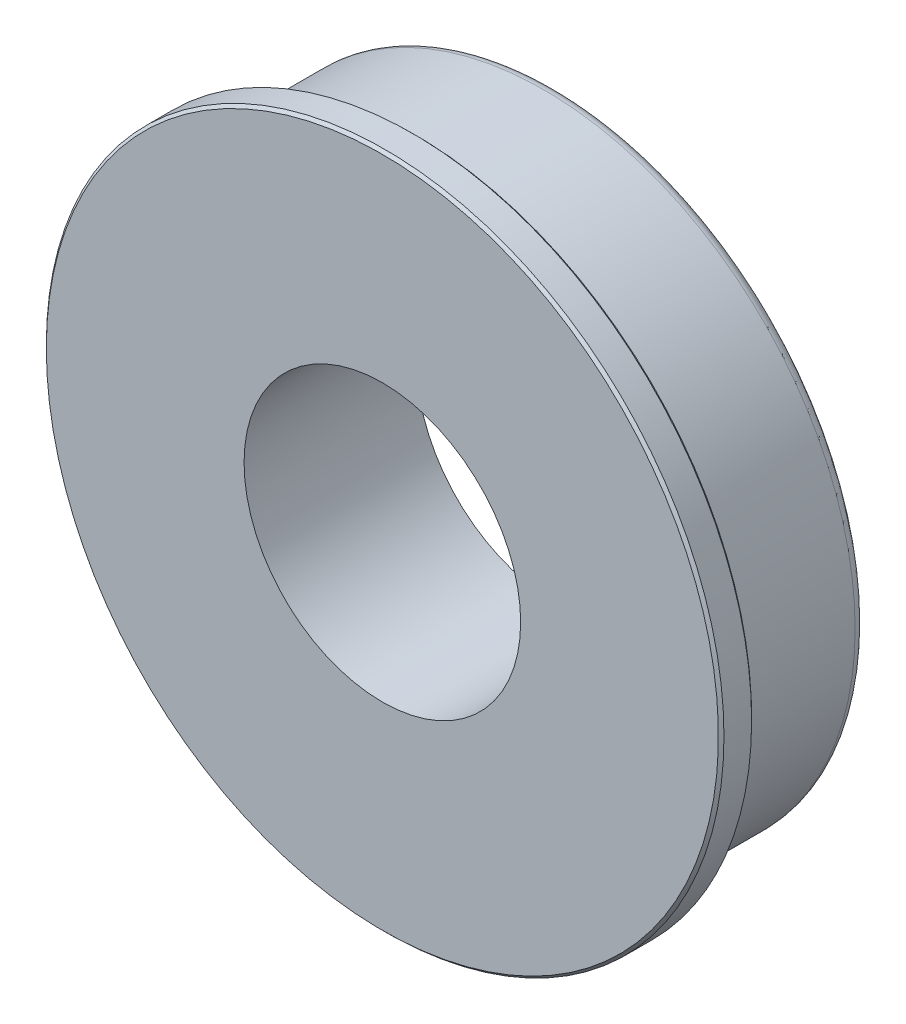
ISO-10303-21;
HEADER;
FILE_DESCRIPTION(('STEP AP214'),'2;1');
FILE_NAME('part.step','',(''),(''),'','','');
FILE_SCHEMA(('AUTOMOTIVE_DESIGN { 1 0 10303 214 1 1 1 1 }'));
ENDSEC;
DATA;
#1=APPLICATION_CONTEXT('core data for automotive mechanical design processes');
#2=APPLICATION_PROTOCOL_DEFINITION('international standard','automotive_design',2000,#1);
#3=PRODUCT_CONTEXT('',#1,'mechanical');
#4=PRODUCT('Part','Part','',(#3));
#5=PRODUCT_RELATED_PRODUCT_CATEGORY('part','',(#4));
#6=PRODUCT_DEFINITION_FORMATION('','',#4);
#7=PRODUCT_DEFINITION_CONTEXT('part definition',#1,'design');
#8=PRODUCT_DEFINITION('design','',#6,#7);
#9=PRODUCT_DEFINITION_SHAPE('','',#8);
#10=(LENGTH_UNIT() NAMED_UNIT(*) SI_UNIT(.MILLI.,.METRE.));
#11=(NAMED_UNIT(*) PLANE_ANGLE_UNIT() SI_UNIT($,.RADIAN.));
#12=(NAMED_UNIT(*) SI_UNIT($,.STERADIAN.) SOLID_ANGLE_UNIT());
#13=UNCERTAINTY_MEASURE_WITH_UNIT(LENGTH_MEASURE(1.E-05),#10,'distance_accuracy_value','');
#14=(GEOMETRIC_REPRESENTATION_CONTEXT(3) GLOBAL_UNCERTAINTY_ASSIGNED_CONTEXT((#13)) GLOBAL_UNIT_ASSIGNED_CONTEXT((#10,
#11,#12)) REPRESENTATION_CONTEXT('',''));
#15=CARTESIAN_POINT('',(0.,0.,0.));
#16=DIRECTION('',(0.,0.,1.));
#17=DIRECTION('',(1.,0.,0.));
#18=AXIS2_PLACEMENT_3D('',#15,#16,#17);
#19=CARTESIAN_POINT('',(0.,47.3069264516129,5.89534));
#20=DIRECTION('',(0.,0.,-1.));
#21=DIRECTION('',(-1.,0.,0.));
#22=AXIS2_PLACEMENT_3D('',#19,#20,#21);
#23=PLANE('',#22);
#24=CARTESIAN_POINT('',(0.,0.,5.89534));
#25=DIRECTION('',(0.,0.,1.));
#26=DIRECTION('',(1.,0.,0.));
#27=AXIS2_PLACEMENT_3D('',#24,#25,#26);
#28=CIRCLE('',#27,14.2875);
#29=CARTESIAN_POINT('',(14.2875,0.,5.89534));
#30=VERTEX_POINT('',#29);
#31=EDGE_CURVE('E46',#30,#30,#28,.F.);
#32=ORIENTED_EDGE('',*,*,#31,.F.);
#33=EDGE_LOOP('',(#32));
#34=FACE_BOUND('',#33,.T.);
#35=CARTESIAN_POINT('',(0.,0.,5.89534));
#36=DIRECTION('',(0.,0.,-1.));
#37=DIRECTION('',(-1.,0.,0.));
#38=AXIS2_PLACEMENT_3D('',#35,#36,#37);
#39=CIRCLE('',#38,13.97);
#40=CARTESIAN_POINT('',(-13.97,0.,5.89534));
#41=VERTEX_POINT('',#40);
#42=EDGE_CURVE('E19',#41,#41,#39,.F.);
#43=ORIENTED_EDGE('',*,*,#42,.F.);
#44=EDGE_LOOP('',(#43));
#45=FACE_BOUND('',#44,.T.);
#46=ADVANCED_FACE('F15',(#34,#45),#23,.F.);
#47=CARTESIAN_POINT('',(0.,0.,-57.007125));
#48=DIRECTION('',(0.,0.,-1.));
#49=DIRECTION('',(-1.,0.,0.));
#50=AXIS2_PLACEMENT_3D('',#47,#48,#49);
#51=CYLINDRICAL_SURFACE('',#50,13.97);
#52=ORIENTED_EDGE('',*,*,#42,.T.);
#53=EDGE_LOOP('',(#52));
#54=FACE_BOUND('',#53,.T.);
#55=CARTESIAN_POINT('',(0.,0.,6.40333999999999));
#56=DIRECTION('',(0.,0.,-1.));
#57=DIRECTION('',(-1.,0.,0.));
#58=AXIS2_PLACEMENT_3D('',#55,#56,#57);
#59=CIRCLE('',#58,13.97);
#60=CARTESIAN_POINT('',(-13.97,0.,6.40333999999999));
#61=VERTEX_POINT('',#60);
#62=EDGE_CURVE('E44',#61,#61,#59,.F.);
#63=ORIENTED_EDGE('',*,*,#62,.F.);
#64=EDGE_LOOP('',(#63));
#65=FACE_BOUND('',#64,.T.);
#66=ADVANCED_FACE('F53',(#54,#65),#51,.T.);
#67=CARTESIAN_POINT('',(0.,0.,6.40334));
#68=DIRECTION('',(0.,0.,1.));
#69=DIRECTION('',(1.,0.,0.));
#70=AXIS2_PLACEMENT_3D('',#67,#68,#69);
#71=CYLINDRICAL_SURFACE('',#70,14.2875);
#72=CARTESIAN_POINT('',(0.,0.,0.508));
#73=DIRECTION('',(0.,0.,-1.));
#74=DIRECTION('',(-1.,0.,0.));
#75=AXIS2_PLACEMENT_3D('',#72,#73,#74);
#76=CIRCLE('',#75,14.2875);
#77=CARTESIAN_POINT('',(-14.2875,0.,0.508));
#78=VERTEX_POINT('',#77);
#79=EDGE_CURVE('E31',#78,#78,#76,.T.);
#80=ORIENTED_EDGE('',*,*,#79,.F.);
#81=EDGE_LOOP('',(#80));
#82=FACE_BOUND('',#81,.T.);
#83=ORIENTED_EDGE('',*,*,#31,.T.);
#84=EDGE_LOOP('',(#83));
#85=FACE_BOUND('',#84,.T.);
#86=ADVANCED_FACE('F61',(#82,#85),#71,.T.);
#87=CARTESIAN_POINT('',(0.,0.,6.40334));
#88=DIRECTION('',(0.,0.,-1.));
#89=DIRECTION('',(-1.,0.,0.));
#90=AXIS2_PLACEMENT_3D('',#87,#88,#89);
#91=PLANE('',#90);
#92=CARTESIAN_POINT('',(0.,0.,6.40334000000001));
#93=DIRECTION('',(0.,0.,1.));
#94=DIRECTION('',(0.,-1.,0.));
#95=AXIS2_PLACEMENT_3D('',#92,#93,#94);
#96=CIRCLE('',#95,15.4305);
#97=CARTESIAN_POINT('',(0.,-15.4305,6.40334000000001));
#98=VERTEX_POINT('',#97);
#99=EDGE_CURVE('E41',#98,#98,#96,.T.);
#100=ORIENTED_EDGE('',*,*,#99,.F.);
#101=EDGE_LOOP('',(#100));
#102=FACE_BOUND('',#101,.T.);
#103=ORIENTED_EDGE('',*,*,#62,.T.);
#104=EDGE_LOOP('',(#103));
#105=FACE_BOUND('',#104,.T.);
#106=ADVANCED_FACE('F91',(#102,#105),#91,.T.);
#107=CARTESIAN_POINT('',(0.,0.,0.508000000000006));
#108=DIRECTION('',(0.,0.,-1.));
#109=DIRECTION('',(-1.,0.,0.));
#110=AXIS2_PLACEMENT_3D('',#107,#108,#109);
#111=TOROIDAL_SURFACE('',#110,13.7795,0.508000000000003);
#112=ORIENTED_EDGE('',*,*,#79,.T.);
#113=EDGE_LOOP('',(#112));
#114=FACE_BOUND('',#113,.T.);
#115=CARTESIAN_POINT('',(0.,0.,0.));
#116=DIRECTION('',(0.,0.,-1.));
#117=DIRECTION('',(-1.,0.,0.));
#118=AXIS2_PLACEMENT_3D('',#115,#116,#117);
#119=CIRCLE('',#118,13.7795);
#120=CARTESIAN_POINT('',(-13.7795,0.,0.));
#121=VERTEX_POINT('',#120);
#122=EDGE_CURVE('E38',#121,#121,#119,.T.);
#123=ORIENTED_EDGE('',*,*,#122,.F.);
#124=EDGE_LOOP('',(#123));
#125=FACE_BOUND('',#124,.T.);
#126=ADVANCED_FACE('F17',(#114,#125),#111,.T.);
#127=CARTESIAN_POINT('',(0.,0.,6.53034));
#128=DIRECTION('',(0.,0.,1.));
#129=DIRECTION('',(0.,-1.,0.));
#130=AXIS2_PLACEMENT_3D('',#127,#128,#129);
#131=CONICAL_SURFACE('',#130,15.5575000000007,0.785398163400003);
#132=CARTESIAN_POINT('',(0.,0.,6.53034));
#133=DIRECTION('',(0.,0.,1.));
#134=DIRECTION('',(1.,0.,0.));
#135=AXIS2_PLACEMENT_3D('',#132,#133,#134);
#136=CIRCLE('',#135,15.5575);
#137=CARTESIAN_POINT('',(15.5575,0.,6.53034));
#138=VERTEX_POINT('',#137);
#139=EDGE_CURVE('E37',#138,#138,#136,.T.);
#140=ORIENTED_EDGE('',*,*,#139,.F.);
#141=EDGE_LOOP('',(#140));
#142=FACE_BOUND('',#141,.T.);
#143=ORIENTED_EDGE('',*,*,#99,.T.);
#144=EDGE_LOOP('',(#143));
#145=FACE_BOUND('',#144,.T.);
#146=ADVANCED_FACE('F86',(#142,#145),#131,.T.);
#147=CARTESIAN_POINT('',(0.,0.,0.));
#148=DIRECTION('',(0.,0.,-1.));
#149=DIRECTION('',(-1.,0.,0.));
#150=AXIS2_PLACEMENT_3D('',#147,#148,#149);
#151=PLANE('',#150);
#152=ORIENTED_EDGE('',*,*,#122,.T.);
#153=EDGE_LOOP('',(#152));
#154=FACE_BOUND('',#153,.T.);
#155=CARTESIAN_POINT('',(0.,0.,0.));
#156=DIRECTION('',(0.,0.,-1.));
#157=DIRECTION('',(-1.,0.,0.));
#158=AXIS2_PLACEMENT_3D('',#155,#156,#157);
#159=CIRCLE('',#158,6.35);
#160=CARTESIAN_POINT('',(-6.34999999999999,0.,0.));
#161=VERTEX_POINT('',#160);
#162=EDGE_CURVE('E34',#161,#161,#159,.F.);
#163=ORIENTED_EDGE('',*,*,#162,.T.);
#164=EDGE_LOOP('',(#163));
#165=FACE_BOUND('',#164,.T.);
#166=ADVANCED_FACE('F82',(#154,#165),#151,.T.);
#167=CARTESIAN_POINT('',(0.,0.,7.92734));
#168=DIRECTION('',(0.,0.,1.));
#169=DIRECTION('',(1.,0.,0.));
#170=AXIS2_PLACEMENT_3D('',#167,#168,#169);
#171=CYLINDRICAL_SURFACE('',#170,15.5575);
#172=CARTESIAN_POINT('',(0.,0.,7.80033999999999));
#173=DIRECTION('',(0.,0.,-1.));
#174=DIRECTION('',(-1.,0.,0.));
#175=AXIS2_PLACEMENT_3D('',#172,#173,#174);
#176=CIRCLE('',#175,15.5575);
#177=CARTESIAN_POINT('',(-15.5575,0.,7.80033999999999));
#178=VERTEX_POINT('',#177);
#179=EDGE_CURVE('E28',#178,#178,#176,.F.);
#180=ORIENTED_EDGE('',*,*,#179,.F.);
#181=EDGE_LOOP('',(#180));
#182=FACE_BOUND('',#181,.T.);
#183=ORIENTED_EDGE('',*,*,#139,.T.);
#184=EDGE_LOOP('',(#183));
#185=FACE_BOUND('',#184,.T.);
#186=ADVANCED_FACE('F78',(#182,#185),#171,.T.);
#187=CARTESIAN_POINT('',(0.,0.,7.92734));
#188=DIRECTION('',(0.,0.,-1.));
#189=DIRECTION('',(-1.,0.,0.));
#190=AXIS2_PLACEMENT_3D('',#187,#188,#189);
#191=CYLINDRICAL_SURFACE('',#190,6.35);
#192=ORIENTED_EDGE('',*,*,#162,.F.);
#193=EDGE_LOOP('',(#192));
#194=FACE_BOUND('',#193,.T.);
#195=CARTESIAN_POINT('',(0.,0.,7.92734));
#196=DIRECTION('',(0.,0.,-1.));
#197=DIRECTION('',(-1.,0.,0.));
#198=AXIS2_PLACEMENT_3D('',#195,#196,#197);
#199=CIRCLE('',#198,6.35);
#200=CARTESIAN_POINT('',(-6.34999999999999,0.,7.92734));
#201=VERTEX_POINT('',#200);
#202=EDGE_CURVE('E23',#201,#201,#199,.F.);
#203=ORIENTED_EDGE('',*,*,#202,.T.);
#204=EDGE_LOOP('',(#203));
#205=FACE_BOUND('',#204,.T.);
#206=ADVANCED_FACE('F71',(#194,#205),#191,.F.);
#207=CARTESIAN_POINT('',(0.,0.,7.80033999999999));
#208=DIRECTION('',(0.,0.,-1.));
#209=DIRECTION('',(-1.,0.,0.));
#210=AXIS2_PLACEMENT_3D('',#207,#208,#209);
#211=CONICAL_SURFACE('',#210,15.5575,0.785398163400003);
#212=ORIENTED_EDGE('',*,*,#179,.T.);
#213=EDGE_LOOP('',(#212));
#214=FACE_BOUND('',#213,.T.);
#215=CARTESIAN_POINT('',(0.,0.,7.92733999999967));
#216=DIRECTION('',(0.,0.,-1.));
#217=DIRECTION('',(-1.,0.,0.));
#218=AXIS2_PLACEMENT_3D('',#215,#216,#217);
#219=CIRCLE('',#218,15.4304999999997);
#220=CARTESIAN_POINT('',(-15.4304999999997,0.,7.92733999999967));
#221=VERTEX_POINT('',#220);
#222=EDGE_CURVE('E9',#221,#221,#219,.T.);
#223=ORIENTED_EDGE('',*,*,#222,.T.);
#224=EDGE_LOOP('',(#223));
#225=FACE_BOUND('',#224,.T.);
#226=ADVANCED_FACE('F65',(#214,#225),#211,.T.);
#227=CARTESIAN_POINT('',(0.,0.,7.92734));
#228=DIRECTION('',(0.,0.,-1.));
#229=DIRECTION('',(-1.,0.,0.));
#230=AXIS2_PLACEMENT_3D('',#227,#228,#229);
#231=PLANE('',#230);
#232=ORIENTED_EDGE('',*,*,#222,.F.);
#233=EDGE_LOOP('',(#232));
#234=FACE_BOUND('',#233,.T.);
#235=ORIENTED_EDGE('',*,*,#202,.F.);
#236=EDGE_LOOP('',(#235));
#237=FACE_BOUND('',#236,.T.);
#238=ADVANCED_FACE('F63',(#234,#237),#231,.F.);
#239=CLOSED_SHELL('',(#46,#66,#86,#106,#126,#146,#166,#186,#206,#226,#238));
#240=MANIFOLD_SOLID_BREP('B1',#239);
#241=ADVANCED_BREP_SHAPE_REPRESENTATION('',(#18,#240),#14);
#242=SHAPE_DEFINITION_REPRESENTATION(#9,#241);
ENDSEC;
END-ISO-10303-21;
